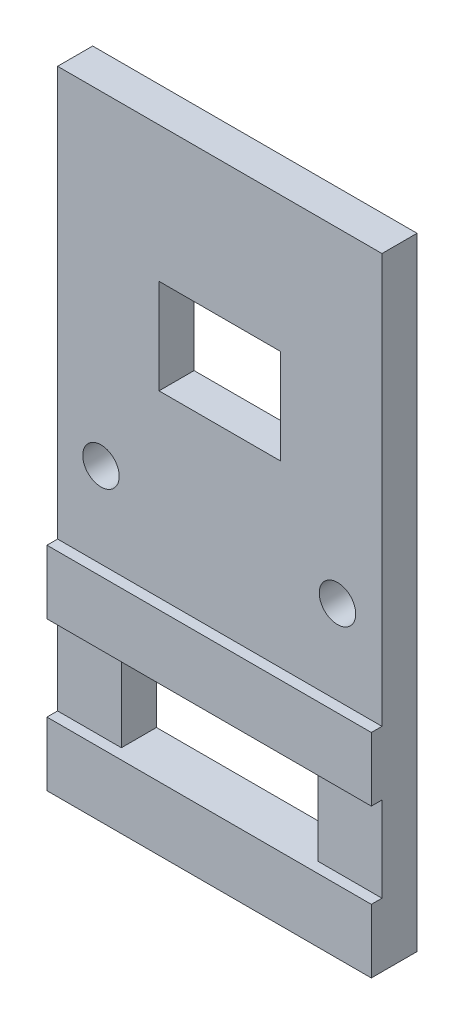
ISO-10303-21;
HEADER;
FILE_DESCRIPTION(('STEP AP214'),'2;1');
FILE_NAME('part.step','',(''),(''),'','','');
FILE_SCHEMA(('AUTOMOTIVE_DESIGN { 1 0 10303 214 1 1 1 1 }'));
ENDSEC;
DATA;
#1=APPLICATION_CONTEXT('core data for automotive mechanical design processes');
#2=APPLICATION_PROTOCOL_DEFINITION('international standard','automotive_design',2000,#1);
#3=PRODUCT_CONTEXT('',#1,'mechanical');
#4=PRODUCT('Part','Part','',(#3));
#5=PRODUCT_RELATED_PRODUCT_CATEGORY('part','',(#4));
#6=PRODUCT_DEFINITION_FORMATION('','',#4);
#7=PRODUCT_DEFINITION_CONTEXT('part definition',#1,'design');
#8=PRODUCT_DEFINITION('design','',#6,#7);
#9=PRODUCT_DEFINITION_SHAPE('','',#8);
#10=(LENGTH_UNIT() NAMED_UNIT(*) SI_UNIT(.MILLI.,.METRE.));
#11=(NAMED_UNIT(*) PLANE_ANGLE_UNIT() SI_UNIT($,.RADIAN.));
#12=(NAMED_UNIT(*) SI_UNIT($,.STERADIAN.) SOLID_ANGLE_UNIT());
#13=UNCERTAINTY_MEASURE_WITH_UNIT(LENGTH_MEASURE(1.E-05),#10,'distance_accuracy_value','');
#14=(GEOMETRIC_REPRESENTATION_CONTEXT(3) GLOBAL_UNCERTAINTY_ASSIGNED_CONTEXT((#13)) GLOBAL_UNIT_ASSIGNED_CONTEXT((#10,
#11,#12)) REPRESENTATION_CONTEXT('',''));
#15=CARTESIAN_POINT('',(0.,0.,0.));
#16=DIRECTION('',(0.,0.,1.));
#17=DIRECTION('',(1.,0.,0.));
#18=AXIS2_PLACEMENT_3D('',#15,#16,#17);
#19=CARTESIAN_POINT('',(0.,0.,3.3));
#20=DIRECTION('',(0.,0.,-1.));
#21=DIRECTION('',(-1.,0.,0.));
#22=AXIS2_PLACEMENT_3D('',#19,#20,#21);
#23=PLANE('',#22);
#24=DIRECTION('',(0.,-1.,0.));
#25=VECTOR('',#24,1.);
#26=CARTESIAN_POINT('',(9.25395283538991,-3.83382208307363,3.3));
#27=LINE('',#26,#25);
#28=CARTESIAN_POINT('',(9.25395283538991,-3.83382208307363,3.3));
#29=VERTEX_POINT('',#28);
#30=CARTESIAN_POINT('',(9.25395283538991,-11.8338220830736,3.3));
#31=VERTEX_POINT('',#30);
#32=EDGE_CURVE('E240',#29,#31,#27,.T.);
#33=ORIENTED_EDGE('',*,*,#32,.T.);
#34=DIRECTION('',(1.,0.,0.));
#35=VECTOR('',#34,1.);
#36=CARTESIAN_POINT('',(0.,-11.8338220830736,3.3));
#37=LINE('',#36,#35);
#38=CARTESIAN_POINT('',(15.2539528353899,-11.8338220830736,3.3));
#39=VERTEX_POINT('',#38);
#40=EDGE_CURVE('E233',#31,#39,#37,.T.);
#41=ORIENTED_EDGE('',*,*,#40,.T.);
#42=DIRECTION('',(0.,-1.,0.));
#43=VECTOR('',#42,1.);
#44=CARTESIAN_POINT('',(15.2539528353899,40.6772075610397,3.3));
#45=LINE('',#44,#43);
#46=CARTESIAN_POINT('',(15.2539528353899,-3.83382208307363,3.3));
#47=VERTEX_POINT('',#46);
#48=EDGE_CURVE('E346',#47,#39,#45,.T.);
#49=ORIENTED_EDGE('',*,*,#48,.F.);
#50=DIRECTION('',(1.,0.,0.));
#51=VECTOR('',#50,1.);
#52=CARTESIAN_POINT('',(0.,-3.83382208307363,3.3));
#53=LINE('',#52,#51);
#54=EDGE_CURVE('E270',#29,#47,#53,.T.);
#55=ORIENTED_EDGE('',*,*,#54,.F.);
#56=EDGE_LOOP('',(#33,#41,#49,#55));
#57=FACE_BOUND('',#56,.T.);
#58=ADVANCED_FACE('F93',(#57),#23,.F.);
#59=CARTESIAN_POINT('',(-15.2539528353899,-11.8338220830736,3.3));
#60=VERTEX_POINT('',#59);
#61=CARTESIAN_POINT('',(-9.2539528353899,-11.8338220830736,3.3));
#62=VERTEX_POINT('',#61);
#63=EDGE_CURVE('E255',#60,#62,#37,.T.);
#64=ORIENTED_EDGE('',*,*,#63,.T.);
#65=DIRECTION('',(0.,-1.,0.));
#66=VECTOR('',#65,1.);
#67=CARTESIAN_POINT('',(-9.2539528353899,-3.83382208307363,3.3));
#68=LINE('',#67,#66);
#69=CARTESIAN_POINT('',(-9.2539528353899,-3.83382208307363,3.3));
#70=VERTEX_POINT('',#69);
#71=EDGE_CURVE('E116',#70,#62,#68,.T.);
#72=ORIENTED_EDGE('',*,*,#71,.F.);
#73=CARTESIAN_POINT('',(-15.2539528353899,-3.83382208307362,3.3));
#74=VERTEX_POINT('',#73);
#75=EDGE_CURVE('E283',#74,#70,#53,.T.);
#76=ORIENTED_EDGE('',*,*,#75,.F.);
#77=DIRECTION('',(0.,-1.,0.));
#78=VECTOR('',#77,1.);
#79=CARTESIAN_POINT('',(-15.2539528353899,40.6772075610397,3.3));
#80=LINE('',#79,#78);
#81=EDGE_CURVE('E349',#74,#60,#80,.T.);
#82=ORIENTED_EDGE('',*,*,#81,.T.);
#83=EDGE_LOOP('',(#64,#72,#76,#82));
#84=FACE_BOUND('',#83,.T.);
#85=ADVANCED_FACE('F410',(#84),#23,.F.);
#86=DIRECTION('',(1.,0.,0.));
#87=VECTOR('',#86,1.);
#88=CARTESIAN_POINT('',(0.,27.9318613374807,3.3));
#89=LINE('',#88,#87);
#90=CARTESIAN_POINT('',(-5.7122807397012,27.9318613374807,3.3));
#91=VERTEX_POINT('',#90);
#92=CARTESIAN_POINT('',(5.71228073970124,27.9318613374807,3.3));
#93=VERTEX_POINT('',#92);
#94=EDGE_CURVE('E314',#91,#93,#89,.T.);
#95=ORIENTED_EDGE('',*,*,#94,.T.);
#96=DIRECTION('',(0.,-1.,0.));
#97=VECTOR('',#96,1.);
#98=CARTESIAN_POINT('',(5.71228073970124,0.,3.3));
#99=LINE('',#98,#97);
#100=CARTESIAN_POINT('',(5.71228073970124,19.0093641658264,3.3));
#101=VERTEX_POINT('',#100);
#102=EDGE_CURVE('E311',#93,#101,#99,.T.);
#103=ORIENTED_EDGE('',*,*,#102,.T.);
#104=DIRECTION('',(1.,0.,0.));
#105=VECTOR('',#104,1.);
#106=CARTESIAN_POINT('',(0.,19.0093641658264,3.3));
#107=LINE('',#106,#105);
#108=CARTESIAN_POINT('',(-5.7122807397012,19.0093641658264,3.3));
#109=VERTEX_POINT('',#108);
#110=EDGE_CURVE('E321',#109,#101,#107,.T.);
#111=ORIENTED_EDGE('',*,*,#110,.F.);
#112=DIRECTION('',(0.,-1.,0.));
#113=VECTOR('',#112,1.);
#114=CARTESIAN_POINT('',(-5.7122807397012,0.,3.3));
#115=LINE('',#114,#113);
#116=EDGE_CURVE('E318',#91,#109,#115,.T.);
#117=ORIENTED_EDGE('',*,*,#116,.F.);
#118=EDGE_LOOP('',(#95,#103,#111,#117));
#119=FACE_BOUND('',#118,.T.);
#120=CARTESIAN_POINT('',(-15.2539528353899,40.6772075610397,3.3));
#121=VERTEX_POINT('',#120);
#122=CARTESIAN_POINT('',(-15.2539528353899,2.16617791692637,3.3));
#123=VERTEX_POINT('',#122);
#124=EDGE_CURVE('E350',#121,#123,#80,.T.);
#125=ORIENTED_EDGE('',*,*,#124,.T.);
#126=DIRECTION('',(1.,0.,0.));
#127=VECTOR('',#126,1.);
#128=CARTESIAN_POINT('',(0.,2.16617791692637,3.3));
#129=LINE('',#128,#127);
#130=CARTESIAN_POINT('',(15.2539528353899,2.16617791692637,3.3));
#131=VERTEX_POINT('',#130);
#132=EDGE_CURVE('E275',#123,#131,#129,.T.);
#133=ORIENTED_EDGE('',*,*,#132,.T.);
#134=CARTESIAN_POINT('',(15.2539528353899,40.6772075610397,3.3));
#135=VERTEX_POINT('',#134);
#136=EDGE_CURVE('E342',#135,#131,#45,.T.);
#137=ORIENTED_EDGE('',*,*,#136,.F.);
#138=DIRECTION('',(1.,0.,0.));
#139=VECTOR('',#138,1.);
#140=CARTESIAN_POINT('',(-15.2539528353899,40.6772075610397,3.3));
#141=LINE('',#140,#139);
#142=EDGE_CURVE('E345',#121,#135,#141,.T.);
#143=ORIENTED_EDGE('',*,*,#142,.F.);
#144=EDGE_LOOP('',(#125,#133,#137,#143));
#145=FACE_BOUND('',#144,.T.);
#146=CARTESIAN_POINT('',(11.0707689335408,10.0808266115212,3.3));
#147=DIRECTION('',(0.,0.,1.));
#148=DIRECTION('',(1.,0.,0.));
#149=AXIS2_PLACEMENT_3D('',#146,#147,#148);
#150=CIRCLE('',#149,1.71606969398138);
#151=CARTESIAN_POINT('',(12.7868386275222,10.0808266115212,3.3));
#152=VERTEX_POINT('',#151);
#153=EDGE_CURVE('E305',#152,#152,#150,.T.);
#154=ORIENTED_EDGE('',*,*,#153,.F.);
#155=EDGE_LOOP('',(#154));
#156=FACE_BOUND('',#155,.T.);
#157=CARTESIAN_POINT('',(-11.1744152121756,10.1661779169264,3.3));
#158=DIRECTION('',(0.,0.,1.));
#159=DIRECTION('',(1.,0.,0.));
#160=AXIS2_PLACEMENT_3D('',#157,#158,#159);
#161=CIRCLE('',#160,1.71606969398137);
#162=CARTESIAN_POINT('',(-9.45834551819422,10.1661779169264,3.3));
#163=VERTEX_POINT('',#162);
#164=EDGE_CURVE('E299',#163,#163,#161,.T.);
#165=ORIENTED_EDGE('',*,*,#164,.F.);
#166=EDGE_LOOP('',(#165));
#167=FACE_BOUND('',#166,.T.);
#168=ADVANCED_FACE('F407',(#119,#145,#156,#167),#23,.F.);
#169=CARTESIAN_POINT('',(0.,0.,0.));
#170=DIRECTION('',(0.,0.,-1.));
#171=DIRECTION('',(-1.,0.,0.));
#172=AXIS2_PLACEMENT_3D('',#169,#170,#171);
#173=PLANE('',#172);
#174=DIRECTION('',(1.,0.,0.));
#175=VECTOR('',#174,1.);
#176=CARTESIAN_POINT('',(-9.2539528353899,-11.8338220830736,0.));
#177=LINE('',#176,#175);
#178=CARTESIAN_POINT('',(-9.2539528353899,-11.8338220830736,0.));
#179=VERTEX_POINT('',#178);
#180=CARTESIAN_POINT('',(9.25395283538991,-11.8338220830736,0.));
#181=VERTEX_POINT('',#180);
#182=EDGE_CURVE('E224',#179,#181,#177,.T.);
#183=ORIENTED_EDGE('',*,*,#182,.T.);
#184=DIRECTION('',(0.,-1.,0.));
#185=VECTOR('',#184,1.);
#186=CARTESIAN_POINT('',(9.25395283538991,-3.83382208307363,0.));
#187=LINE('',#186,#185);
#188=CARTESIAN_POINT('',(9.25395283538991,-3.83382208307363,0.));
#189=VERTEX_POINT('',#188);
#190=EDGE_CURVE('E215',#189,#181,#187,.T.);
#191=ORIENTED_EDGE('',*,*,#190,.F.);
#192=DIRECTION('',(1.,0.,0.));
#193=VECTOR('',#192,1.);
#194=CARTESIAN_POINT('',(-9.2539528353899,-3.83382208307363,0.));
#195=LINE('',#194,#193);
#196=CARTESIAN_POINT('',(-9.2539528353899,-3.83382208307363,0.));
#197=VERTEX_POINT('',#196);
#198=EDGE_CURVE('E223',#197,#189,#195,.T.);
#199=ORIENTED_EDGE('',*,*,#198,.F.);
#200=DIRECTION('',(0.,-1.,0.));
#201=VECTOR('',#200,1.);
#202=CARTESIAN_POINT('',(-9.2539528353899,-3.83382208307363,0.));
#203=LINE('',#202,#201);
#204=EDGE_CURVE('E234',#197,#179,#203,.T.);
#205=ORIENTED_EDGE('',*,*,#204,.T.);
#206=EDGE_LOOP('',(#183,#191,#199,#205));
#207=FACE_BOUND('',#206,.T.);
#208=CARTESIAN_POINT('',(11.0707689335408,10.0808266115212,0.));
#209=DIRECTION('',(0.,0.,1.));
#210=DIRECTION('',(1.,0.,0.));
#211=AXIS2_PLACEMENT_3D('',#208,#209,#210);
#212=CIRCLE('',#211,1.71606969398138);
#213=CARTESIAN_POINT('',(12.7868386275222,10.0808266115212,0.));
#214=VERTEX_POINT('',#213);
#215=EDGE_CURVE('E302',#214,#214,#212,.T.);
#216=ORIENTED_EDGE('',*,*,#215,.T.);
#217=EDGE_LOOP('',(#216));
#218=FACE_BOUND('',#217,.T.);
#219=DIRECTION('',(0.,-1.,0.));
#220=VECTOR('',#219,1.);
#221=CARTESIAN_POINT('',(5.71228073970124,0.,0.));
#222=LINE('',#221,#220);
#223=CARTESIAN_POINT('',(5.71228073970124,27.9318613374807,0.));
#224=VERTEX_POINT('',#223);
#225=CARTESIAN_POINT('',(5.71228073970124,19.0093641658264,0.));
#226=VERTEX_POINT('',#225);
#227=EDGE_CURVE('E308',#224,#226,#222,.T.);
#228=ORIENTED_EDGE('',*,*,#227,.F.);
#229=DIRECTION('',(1.,0.,0.));
#230=VECTOR('',#229,1.);
#231=CARTESIAN_POINT('',(0.,27.9318613374807,0.));
#232=LINE('',#231,#230);
#233=CARTESIAN_POINT('',(-5.7122807397012,27.9318613374807,0.));
#234=VERTEX_POINT('',#233);
#235=EDGE_CURVE('E325',#234,#224,#232,.T.);
#236=ORIENTED_EDGE('',*,*,#235,.F.);
#237=DIRECTION('',(0.,-1.,0.));
#238=VECTOR('',#237,1.);
#239=CARTESIAN_POINT('',(-5.7122807397012,0.,0.));
#240=LINE('',#239,#238);
#241=CARTESIAN_POINT('',(-5.7122807397012,19.0093641658264,0.));
#242=VERTEX_POINT('',#241);
#243=EDGE_CURVE('E328',#234,#242,#240,.T.);
#244=ORIENTED_EDGE('',*,*,#243,.T.);
#245=DIRECTION('',(1.,0.,0.));
#246=VECTOR('',#245,1.);
#247=CARTESIAN_POINT('',(0.,19.0093641658264,0.));
#248=LINE('',#247,#246);
#249=EDGE_CURVE('E315',#242,#226,#248,.T.);
#250=ORIENTED_EDGE('',*,*,#249,.T.);
#251=EDGE_LOOP('',(#228,#236,#244,#250));
#252=FACE_BOUND('',#251,.T.);
#253=DIRECTION('',(1.,0.,0.));
#254=VECTOR('',#253,1.);
#255=CARTESIAN_POINT('',(-15.2539528353899,-17.8338220830736,0.));
#256=LINE('',#255,#254);
#257=CARTESIAN_POINT('',(-15.2539528353899,-17.8338220830736,0.));
#258=VERTEX_POINT('',#257);
#259=CARTESIAN_POINT('',(15.2539528353899,-17.8338220830736,0.));
#260=VERTEX_POINT('',#259);
#261=EDGE_CURVE('E341',#258,#260,#256,.T.);
#262=ORIENTED_EDGE('',*,*,#261,.F.);
#263=DIRECTION('',(0.,-1.,0.));
#264=VECTOR('',#263,1.);
#265=CARTESIAN_POINT('',(-15.2539528353899,40.6772075610397,0.));
#266=LINE('',#265,#264);
#267=CARTESIAN_POINT('',(-15.2539528353899,40.6772075610397,0.));
#268=VERTEX_POINT('',#267);
#269=EDGE_CURVE('E361',#268,#258,#266,.T.);
#270=ORIENTED_EDGE('',*,*,#269,.F.);
#271=DIRECTION('',(1.,0.,0.));
#272=VECTOR('',#271,1.);
#273=CARTESIAN_POINT('',(-15.2539528353899,40.6772075610397,0.));
#274=LINE('',#273,#272);
#275=CARTESIAN_POINT('',(15.2539528353899,40.6772075610397,0.));
#276=VERTEX_POINT('',#275);
#277=EDGE_CURVE('E358',#268,#276,#274,.T.);
#278=ORIENTED_EDGE('',*,*,#277,.T.);
#279=DIRECTION('',(0.,-1.,0.));
#280=VECTOR('',#279,1.);
#281=CARTESIAN_POINT('',(15.2539528353899,40.6772075610397,0.));
#282=LINE('',#281,#280);
#283=EDGE_CURVE('E355',#276,#260,#282,.T.);
#284=ORIENTED_EDGE('',*,*,#283,.T.);
#285=EDGE_LOOP('',(#262,#270,#278,#284));
#286=FACE_BOUND('',#285,.T.);
#287=CARTESIAN_POINT('',(-11.1744152121756,10.1661779169264,0.));
#288=DIRECTION('',(0.,0.,1.));
#289=DIRECTION('',(1.,0.,0.));
#290=AXIS2_PLACEMENT_3D('',#287,#288,#289);
#291=CIRCLE('',#290,1.71606969398137);
#292=CARTESIAN_POINT('',(-9.45834551819422,10.1661779169264,0.));
#293=VERTEX_POINT('',#292);
#294=EDGE_CURVE('E298',#293,#293,#291,.T.);
#295=ORIENTED_EDGE('',*,*,#294,.T.);
#296=EDGE_LOOP('',(#295));
#297=FACE_BOUND('',#296,.T.);
#298=ADVANCED_FACE('F236',(#207,#218,#252,#286,#297),#173,.T.);
#299=CARTESIAN_POINT('',(-15.2539528353899,-17.8338220830736,3.3));
#300=DIRECTION('',(0.,1.,0.));
#301=DIRECTION('',(0.,0.,1.));
#302=AXIS2_PLACEMENT_3D('',#299,#300,#301);
#303=PLANE('',#302);
#304=ORIENTED_EDGE('',*,*,#261,.T.);
#305=DIRECTION('',(0.,0.,-1.));
#306=VECTOR('',#305,1.);
#307=CARTESIAN_POINT('',(15.2539528353899,-17.8338220830736,3.3));
#308=LINE('',#307,#306);
#309=CARTESIAN_POINT('',(15.2539528353899,-17.8338220830736,4.3));
#310=VERTEX_POINT('',#309);
#311=EDGE_CURVE('E12',#310,#260,#308,.T.);
#312=ORIENTED_EDGE('',*,*,#311,.F.);
#313=DIRECTION('',(1.,0.,0.));
#314=VECTOR('',#313,1.);
#315=CARTESIAN_POINT('',(0.,-17.8338220830736,4.3));
#316=LINE('',#315,#314);
#317=CARTESIAN_POINT('',(-15.2539528353899,-17.8338220830736,4.3));
#318=VERTEX_POINT('',#317);
#319=EDGE_CURVE('E258',#318,#310,#316,.T.);
#320=ORIENTED_EDGE('',*,*,#319,.F.);
#321=DIRECTION('',(0.,0.,-1.));
#322=VECTOR('',#321,1.);
#323=CARTESIAN_POINT('',(-15.2539528353899,-17.8338220830736,3.3));
#324=LINE('',#323,#322);
#325=EDGE_CURVE('E352',#318,#258,#324,.T.);
#326=ORIENTED_EDGE('',*,*,#325,.T.);
#327=EDGE_LOOP('',(#304,#312,#320,#326));
#328=FACE_BOUND('',#327,.T.);
#329=ADVANCED_FACE('F95',(#328),#303,.F.);
#330=CARTESIAN_POINT('',(15.2539528353899,40.6772075610397,3.3));
#331=DIRECTION('',(1.,0.,0.));
#332=DIRECTION('',(0.,1.,0.));
#333=AXIS2_PLACEMENT_3D('',#330,#331,#332);
#334=PLANE('',#333);
#335=ORIENTED_EDGE('',*,*,#283,.F.);
#336=DIRECTION('',(0.,0.,-1.));
#337=VECTOR('',#336,1.);
#338=CARTESIAN_POINT('',(15.2539528353899,40.6772075610397,3.3));
#339=LINE('',#338,#337);
#340=EDGE_CURVE('E101',#135,#276,#339,.T.);
#341=ORIENTED_EDGE('',*,*,#340,.F.);
#342=ORIENTED_EDGE('',*,*,#136,.T.);
#343=DIRECTION('',(0.,0.,-1.));
#344=VECTOR('',#343,1.);
#345=CARTESIAN_POINT('',(15.2539528353899,2.16617791692637,4.3));
#346=LINE('',#345,#344);
#347=CARTESIAN_POINT('',(15.2539528353899,2.16617791692637,4.3));
#348=VERTEX_POINT('',#347);
#349=EDGE_CURVE('E289',#348,#131,#346,.T.);
#350=ORIENTED_EDGE('',*,*,#349,.F.);
#351=DIRECTION('',(0.,1.,0.));
#352=VECTOR('',#351,1.);
#353=CARTESIAN_POINT('',(15.2539528353899,0.,4.3));
#354=LINE('',#353,#352);
#355=CARTESIAN_POINT('',(15.2539528353899,-3.83382208307363,4.3));
#356=VERTEX_POINT('',#355);
#357=EDGE_CURVE('E277',#356,#348,#354,.T.);
#358=ORIENTED_EDGE('',*,*,#357,.F.);
#359=DIRECTION('',(0.,0.,-1.));
#360=VECTOR('',#359,1.);
#361=CARTESIAN_POINT('',(15.2539528353899,-3.83382208307363,4.3));
#362=LINE('',#361,#360);
#363=EDGE_CURVE('E292',#356,#47,#362,.T.);
#364=ORIENTED_EDGE('',*,*,#363,.T.);
#365=ORIENTED_EDGE('',*,*,#48,.T.);
#366=DIRECTION('',(0.,0.,-1.));
#367=VECTOR('',#366,1.);
#368=CARTESIAN_POINT('',(15.2539528353899,-11.8338220830736,4.3));
#369=LINE('',#368,#367);
#370=CARTESIAN_POINT('',(15.2539528353899,-11.8338220830736,4.3));
#371=VERTEX_POINT('',#370);
#372=EDGE_CURVE('E263',#371,#39,#369,.T.);
#373=ORIENTED_EDGE('',*,*,#372,.F.);
#374=DIRECTION('',(0.,1.,0.));
#375=VECTOR('',#374,1.);
#376=CARTESIAN_POINT('',(15.2539528353899,0.,4.3));
#377=LINE('',#376,#375);
#378=EDGE_CURVE('E261',#310,#371,#377,.T.);
#379=ORIENTED_EDGE('',*,*,#378,.F.);
#380=ORIENTED_EDGE('',*,*,#311,.T.);
#381=EDGE_LOOP('',(#335,#341,#342,#350,#358,#364,#365,#373,#379,#380));
#382=FACE_BOUND('',#381,.T.);
#383=ADVANCED_FACE('F373',(#382),#334,.T.);
#384=CARTESIAN_POINT('',(-15.2539528353899,40.6772075610397,3.3));
#385=DIRECTION('',(0.,1.,0.));
#386=DIRECTION('',(0.,0.,1.));
#387=AXIS2_PLACEMENT_3D('',#384,#385,#386);
#388=PLANE('',#387);
#389=ORIENTED_EDGE('',*,*,#277,.F.);
#390=DIRECTION('',(0.,0.,-1.));
#391=VECTOR('',#390,1.);
#392=CARTESIAN_POINT('',(-15.2539528353899,40.6772075610397,3.3));
#393=LINE('',#392,#391);
#394=EDGE_CURVE('E365',#121,#268,#393,.T.);
#395=ORIENTED_EDGE('',*,*,#394,.F.);
#396=ORIENTED_EDGE('',*,*,#142,.T.);
#397=ORIENTED_EDGE('',*,*,#340,.T.);
#398=EDGE_LOOP('',(#389,#395,#396,#397));
#399=FACE_BOUND('',#398,.T.);
#400=ADVANCED_FACE('F369',(#399),#388,.T.);
#401=CARTESIAN_POINT('',(-15.2539528353899,40.6772075610397,3.3));
#402=DIRECTION('',(1.,0.,0.));
#403=DIRECTION('',(0.,1.,0.));
#404=AXIS2_PLACEMENT_3D('',#401,#402,#403);
#405=PLANE('',#404);
#406=ORIENTED_EDGE('',*,*,#269,.T.);
#407=ORIENTED_EDGE('',*,*,#325,.F.);
#408=DIRECTION('',(0.,-1.,0.));
#409=VECTOR('',#408,1.);
#410=CARTESIAN_POINT('',(-15.2539528353899,0.,4.3));
#411=LINE('',#410,#409);
#412=CARTESIAN_POINT('',(-15.2539528353899,-11.8338220830736,4.3));
#413=VERTEX_POINT('',#412);
#414=EDGE_CURVE('E254',#413,#318,#411,.T.);
#415=ORIENTED_EDGE('',*,*,#414,.F.);
#416=DIRECTION('',(0.,0.,-1.));
#417=VECTOR('',#416,1.);
#418=CARTESIAN_POINT('',(-15.2539528353899,-11.8338220830736,4.3));
#419=LINE('',#418,#417);
#420=EDGE_CURVE('E267',#413,#60,#419,.T.);
#421=ORIENTED_EDGE('',*,*,#420,.T.);
#422=ORIENTED_EDGE('',*,*,#81,.F.);
#423=DIRECTION('',(0.,0.,-1.));
#424=VECTOR('',#423,1.);
#425=CARTESIAN_POINT('',(-15.2539528353899,-3.83382208307363,4.3));
#426=LINE('',#425,#424);
#427=CARTESIAN_POINT('',(-15.2539528353899,-3.83382208307363,4.3));
#428=VERTEX_POINT('',#427);
#429=EDGE_CURVE('E295',#428,#74,#426,.T.);
#430=ORIENTED_EDGE('',*,*,#429,.F.);
#431=DIRECTION('',(0.,-1.,0.));
#432=VECTOR('',#431,1.);
#433=CARTESIAN_POINT('',(-15.2539528353899,0.,4.3));
#434=LINE('',#433,#432);
#435=CARTESIAN_POINT('',(-15.2539528353899,2.16617791692637,4.3));
#436=VERTEX_POINT('',#435);
#437=EDGE_CURVE('E271',#436,#428,#434,.T.);
#438=ORIENTED_EDGE('',*,*,#437,.F.);
#439=DIRECTION('',(0.,0.,-1.));
#440=VECTOR('',#439,1.);
#441=CARTESIAN_POINT('',(-15.2539528353899,2.16617791692637,4.3));
#442=LINE('',#441,#440);
#443=EDGE_CURVE('E282',#436,#123,#442,.T.);
#444=ORIENTED_EDGE('',*,*,#443,.T.);
#445=ORIENTED_EDGE('',*,*,#124,.F.);
#446=ORIENTED_EDGE('',*,*,#394,.T.);
#447=EDGE_LOOP('',(#406,#407,#415,#421,#422,#430,#438,#444,#445,#446));
#448=FACE_BOUND('',#447,.T.);
#449=ADVANCED_FACE('F380',(#448),#405,.F.);
#450=CARTESIAN_POINT('',(5.71228073970124,0.,3.3));
#451=DIRECTION('',(1.,0.,0.));
#452=DIRECTION('',(0.,0.,-1.));
#453=AXIS2_PLACEMENT_3D('',#450,#451,#452);
#454=PLANE('',#453);
#455=ORIENTED_EDGE('',*,*,#227,.T.);
#456=DIRECTION('',(0.,0.,-1.));
#457=VECTOR('',#456,1.);
#458=CARTESIAN_POINT('',(5.71228073970124,19.0093641658264,3.3));
#459=LINE('',#458,#457);
#460=EDGE_CURVE('E323',#101,#226,#459,.T.);
#461=ORIENTED_EDGE('',*,*,#460,.F.);
#462=ORIENTED_EDGE('',*,*,#102,.F.);
#463=DIRECTION('',(0.,0.,-1.));
#464=VECTOR('',#463,1.);
#465=CARTESIAN_POINT('',(5.71228073970124,27.9318613374807,3.3));
#466=LINE('',#465,#464);
#467=EDGE_CURVE('E339',#93,#224,#466,.T.);
#468=ORIENTED_EDGE('',*,*,#467,.T.);
#469=EDGE_LOOP('',(#455,#461,#462,#468));
#470=FACE_BOUND('',#469,.T.);
#471=ADVANCED_FACE('F435',(#470),#454,.F.);
#472=CARTESIAN_POINT('',(0.,27.9318613374807,3.3));
#473=DIRECTION('',(0.,1.,0.));
#474=DIRECTION('',(0.,0.,1.));
#475=AXIS2_PLACEMENT_3D('',#472,#473,#474);
#476=PLANE('',#475);
#477=ORIENTED_EDGE('',*,*,#235,.T.);
#478=ORIENTED_EDGE('',*,*,#467,.F.);
#479=ORIENTED_EDGE('',*,*,#94,.F.);
#480=DIRECTION('',(0.,0.,-1.));
#481=VECTOR('',#480,1.);
#482=CARTESIAN_POINT('',(-5.7122807397012,27.9318613374807,3.3));
#483=LINE('',#482,#481);
#484=EDGE_CURVE('E337',#91,#234,#483,.T.);
#485=ORIENTED_EDGE('',*,*,#484,.T.);
#486=EDGE_LOOP('',(#477,#478,#479,#485));
#487=FACE_BOUND('',#486,.T.);
#488=ADVANCED_FACE('F438',(#487),#476,.F.);
#489=CARTESIAN_POINT('',(-5.7122807397012,0.,3.3));
#490=DIRECTION('',(1.,0.,0.));
#491=DIRECTION('',(0.,0.,-1.));
#492=AXIS2_PLACEMENT_3D('',#489,#490,#491);
#493=PLANE('',#492);
#494=ORIENTED_EDGE('',*,*,#243,.F.);
#495=ORIENTED_EDGE('',*,*,#484,.F.);
#496=ORIENTED_EDGE('',*,*,#116,.T.);
#497=DIRECTION('',(0.,0.,-1.));
#498=VECTOR('',#497,1.);
#499=CARTESIAN_POINT('',(-5.7122807397012,19.0093641658264,3.3));
#500=LINE('',#499,#498);
#501=EDGE_CURVE('E335',#109,#242,#500,.T.);
#502=ORIENTED_EDGE('',*,*,#501,.T.);
#503=EDGE_LOOP('',(#494,#495,#496,#502));
#504=FACE_BOUND('',#503,.T.);
#505=ADVANCED_FACE('F442',(#504),#493,.T.);
#506=CARTESIAN_POINT('',(0.,19.0093641658264,3.3));
#507=DIRECTION('',(0.,1.,0.));
#508=DIRECTION('',(0.,0.,1.));
#509=AXIS2_PLACEMENT_3D('',#506,#507,#508);
#510=PLANE('',#509);
#511=ORIENTED_EDGE('',*,*,#249,.F.);
#512=ORIENTED_EDGE('',*,*,#501,.F.);
#513=ORIENTED_EDGE('',*,*,#110,.T.);
#514=ORIENTED_EDGE('',*,*,#460,.T.);
#515=EDGE_LOOP('',(#511,#512,#513,#514));
#516=FACE_BOUND('',#515,.T.);
#517=ADVANCED_FACE('F446',(#516),#510,.T.);
#518=CARTESIAN_POINT('',(11.0707689335408,10.0808266115212,3.3));
#519=DIRECTION('',(0.,0.,-1.));
#520=DIRECTION('',(-1.,0.,0.));
#521=AXIS2_PLACEMENT_3D('',#518,#519,#520);
#522=CYLINDRICAL_SURFACE('',#521,1.71606969398138);
#523=ORIENTED_EDGE('',*,*,#153,.T.);
#524=EDGE_LOOP('',(#523));
#525=FACE_BOUND('',#524,.T.);
#526=ORIENTED_EDGE('',*,*,#215,.F.);
#527=EDGE_LOOP('',(#526));
#528=FACE_BOUND('',#527,.T.);
#529=ADVANCED_FACE('F420',(#525,#528),#522,.F.);
#530=CARTESIAN_POINT('',(-11.1744152121756,10.1661779169264,3.3));
#531=DIRECTION('',(0.,0.,-1.));
#532=DIRECTION('',(-1.,0.,0.));
#533=AXIS2_PLACEMENT_3D('',#530,#531,#532);
#534=CYLINDRICAL_SURFACE('',#533,1.71606969398137);
#535=ORIENTED_EDGE('',*,*,#164,.T.);
#536=EDGE_LOOP('',(#535));
#537=FACE_BOUND('',#536,.T.);
#538=ORIENTED_EDGE('',*,*,#294,.F.);
#539=EDGE_LOOP('',(#538));
#540=FACE_BOUND('',#539,.T.);
#541=ADVANCED_FACE('F417',(#537,#540),#534,.F.);
#542=CARTESIAN_POINT('',(0.,-3.83382208307363,4.3));
#543=DIRECTION('',(0.,1.,0.));
#544=DIRECTION('',(0.,0.,1.));
#545=AXIS2_PLACEMENT_3D('',#542,#543,#544);
#546=PLANE('',#545);
#547=ORIENTED_EDGE('',*,*,#75,.T.);
#548=DIRECTION('',(0.,0.,1.));
#549=VECTOR('',#548,1.);
#550=CARTESIAN_POINT('',(-9.2539528353899,-3.83382208307363,0.));
#551=LINE('',#550,#549);
#552=EDGE_CURVE('E248',#197,#70,#551,.T.);
#553=ORIENTED_EDGE('',*,*,#552,.F.);
#554=ORIENTED_EDGE('',*,*,#198,.T.);
#555=DIRECTION('',(0.,0.,1.));
#556=VECTOR('',#555,1.);
#557=CARTESIAN_POINT('',(9.25395283538991,-3.83382208307363,0.));
#558=LINE('',#557,#556);
#559=EDGE_CURVE('E108',#189,#29,#558,.T.);
#560=ORIENTED_EDGE('',*,*,#559,.T.);
#561=ORIENTED_EDGE('',*,*,#54,.T.);
#562=ORIENTED_EDGE('',*,*,#363,.F.);
#563=DIRECTION('',(1.,0.,0.));
#564=VECTOR('',#563,1.);
#565=CARTESIAN_POINT('',(0.,-3.83382208307363,4.3));
#566=LINE('',#565,#564);
#567=EDGE_CURVE('E274',#428,#356,#566,.T.);
#568=ORIENTED_EDGE('',*,*,#567,.F.);
#569=ORIENTED_EDGE('',*,*,#429,.T.);
#570=EDGE_LOOP('',(#547,#553,#554,#560,#561,#562,#568,#569));
#571=FACE_BOUND('',#570,.T.);
#572=ADVANCED_FACE('F396',(#571),#546,.F.);
#573=CARTESIAN_POINT('',(0.,2.16617791692637,4.3));
#574=DIRECTION('',(0.,1.,0.));
#575=DIRECTION('',(0.,0.,1.));
#576=AXIS2_PLACEMENT_3D('',#573,#574,#575);
#577=PLANE('',#576);
#578=ORIENTED_EDGE('',*,*,#132,.F.);
#579=ORIENTED_EDGE('',*,*,#443,.F.);
#580=DIRECTION('',(1.,0.,0.));
#581=VECTOR('',#580,1.);
#582=CARTESIAN_POINT('',(0.,2.16617791692637,4.3));
#583=LINE('',#582,#581);
#584=EDGE_CURVE('E279',#436,#348,#583,.T.);
#585=ORIENTED_EDGE('',*,*,#584,.T.);
#586=ORIENTED_EDGE('',*,*,#349,.T.);
#587=EDGE_LOOP('',(#578,#579,#585,#586));
#588=FACE_BOUND('',#587,.T.);
#589=ADVANCED_FACE('F404',(#588),#577,.T.);
#590=CARTESIAN_POINT('',(0.,0.,4.3));
#591=DIRECTION('',(0.,0.,1.));
#592=DIRECTION('',(1.,0.,0.));
#593=AXIS2_PLACEMENT_3D('',#590,#591,#592);
#594=PLANE('',#593);
#595=ORIENTED_EDGE('',*,*,#437,.T.);
#596=ORIENTED_EDGE('',*,*,#567,.T.);
#597=ORIENTED_EDGE('',*,*,#357,.T.);
#598=ORIENTED_EDGE('',*,*,#584,.F.);
#599=EDGE_LOOP('',(#595,#596,#597,#598));
#600=FACE_BOUND('',#599,.T.);
#601=ADVANCED_FACE('F401',(#600),#594,.T.);
#602=CARTESIAN_POINT('',(0.,-11.8338220830736,4.3));
#603=DIRECTION('',(0.,1.,0.));
#604=DIRECTION('',(0.,0.,1.));
#605=AXIS2_PLACEMENT_3D('',#602,#603,#604);
#606=PLANE('',#605);
#607=ORIENTED_EDGE('',*,*,#63,.F.);
#608=ORIENTED_EDGE('',*,*,#420,.F.);
#609=DIRECTION('',(1.,0.,0.));
#610=VECTOR('',#609,1.);
#611=CARTESIAN_POINT('',(0.,-11.8338220830736,4.3));
#612=LINE('',#611,#610);
#613=EDGE_CURVE('E251',#413,#371,#612,.T.);
#614=ORIENTED_EDGE('',*,*,#613,.T.);
#615=ORIENTED_EDGE('',*,*,#372,.T.);
#616=ORIENTED_EDGE('',*,*,#40,.F.);
#617=DIRECTION('',(0.,0.,1.));
#618=VECTOR('',#617,1.);
#619=CARTESIAN_POINT('',(9.25395283538991,-11.8338220830736,0.));
#620=LINE('',#619,#618);
#621=EDGE_CURVE('E218',#181,#31,#620,.T.);
#622=ORIENTED_EDGE('',*,*,#621,.F.);
#623=ORIENTED_EDGE('',*,*,#182,.F.);
#624=DIRECTION('',(0.,0.,1.));
#625=VECTOR('',#624,1.);
#626=CARTESIAN_POINT('',(-9.2539528353899,-11.8338220830736,0.));
#627=LINE('',#626,#625);
#628=EDGE_CURVE('E246',#179,#62,#627,.T.);
#629=ORIENTED_EDGE('',*,*,#628,.T.);
#630=EDGE_LOOP('',(#607,#608,#614,#615,#616,#622,#623,#629));
#631=FACE_BOUND('',#630,.T.);
#632=ADVANCED_FACE('F230',(#631),#606,.T.);
#633=CARTESIAN_POINT('',(0.,0.,4.3));
#634=DIRECTION('',(0.,0.,1.));
#635=DIRECTION('',(1.,0.,0.));
#636=AXIS2_PLACEMENT_3D('',#633,#634,#635);
#637=PLANE('',#636);
#638=ORIENTED_EDGE('',*,*,#613,.F.);
#639=ORIENTED_EDGE('',*,*,#414,.T.);
#640=ORIENTED_EDGE('',*,*,#319,.T.);
#641=ORIENTED_EDGE('',*,*,#378,.T.);
#642=EDGE_LOOP('',(#638,#639,#640,#641));
#643=FACE_BOUND('',#642,.T.);
#644=ADVANCED_FACE('F387',(#643),#637,.T.);
#645=CARTESIAN_POINT('',(-9.2539528353899,-3.83382208307363,0.));
#646=DIRECTION('',(-1.,0.,0.));
#647=DIRECTION('',(0.,-1.,0.));
#648=AXIS2_PLACEMENT_3D('',#645,#646,#647);
#649=PLANE('',#648);
#650=ORIENTED_EDGE('',*,*,#71,.T.);
#651=ORIENTED_EDGE('',*,*,#628,.F.);
#652=ORIENTED_EDGE('',*,*,#204,.F.);
#653=ORIENTED_EDGE('',*,*,#552,.T.);
#654=EDGE_LOOP('',(#650,#651,#652,#653));
#655=FACE_BOUND('',#654,.T.);
#656=ADVANCED_FACE('F464',(#655),#649,.F.);
#657=CARTESIAN_POINT('',(9.25395283538991,-3.83382208307363,0.));
#658=DIRECTION('',(-1.,0.,0.));
#659=DIRECTION('',(0.,0.,1.));
#660=AXIS2_PLACEMENT_3D('',#657,#658,#659);
#661=PLANE('',#660);
#662=ORIENTED_EDGE('',*,*,#32,.F.);
#663=ORIENTED_EDGE('',*,*,#559,.F.);
#664=ORIENTED_EDGE('',*,*,#190,.T.);
#665=ORIENTED_EDGE('',*,*,#621,.T.);
#666=EDGE_LOOP('',(#662,#663,#664,#665));
#667=FACE_BOUND('',#666,.T.);
#668=ADVANCED_FACE('F217',(#667),#661,.T.);
#669=CLOSED_SHELL('',(#58,#85,#168,#298,#329,#383,#400,#449,#471,#488,#505,#517,#529,#541,#572,
#589,#601,#632,#644,#656,#668));
#670=MANIFOLD_SOLID_BREP('B2',#669);
#671=ADVANCED_BREP_SHAPE_REPRESENTATION('',(#18,#670),#14);
#672=SHAPE_DEFINITION_REPRESENTATION(#9,#671);
ENDSEC;
END-ISO-10303-21;
